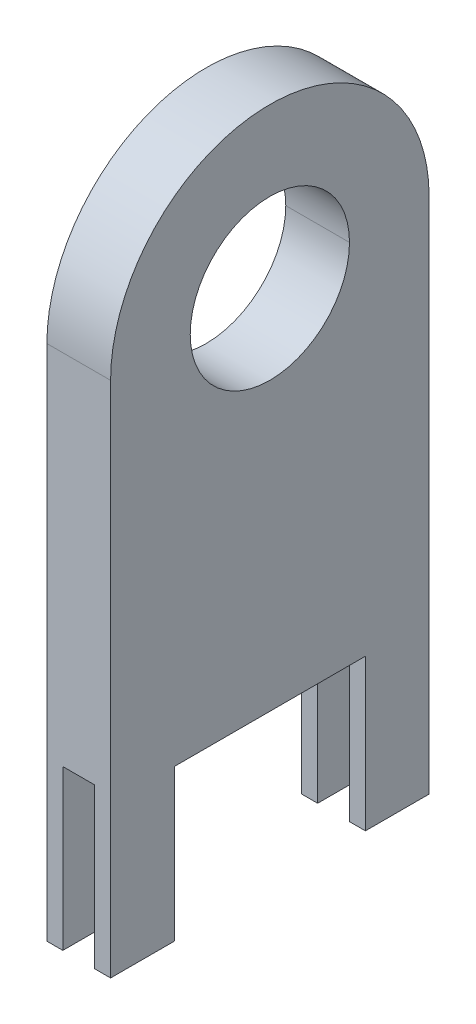
ISO-10303-21;
HEADER;
FILE_DESCRIPTION(('STEP AP214'),'2;1');
FILE_NAME('part.step','',(''),(''),'','','');
FILE_SCHEMA(('AUTOMOTIVE_DESIGN { 1 0 10303 214 1 1 1 1 }'));
ENDSEC;
DATA;
#1=APPLICATION_CONTEXT('core data for automotive mechanical design processes');
#2=APPLICATION_PROTOCOL_DEFINITION('international standard','automotive_design',2000,#1);
#3=PRODUCT_CONTEXT('',#1,'mechanical');
#4=PRODUCT('Part','Part','',(#3));
#5=PRODUCT_RELATED_PRODUCT_CATEGORY('part','',(#4));
#6=PRODUCT_DEFINITION_FORMATION('','',#4);
#7=PRODUCT_DEFINITION_CONTEXT('part definition',#1,'design');
#8=PRODUCT_DEFINITION('design','',#6,#7);
#9=PRODUCT_DEFINITION_SHAPE('','',#8);
#10=(LENGTH_UNIT() NAMED_UNIT(*) SI_UNIT(.MILLI.,.METRE.));
#11=(NAMED_UNIT(*) PLANE_ANGLE_UNIT() SI_UNIT($,.RADIAN.));
#12=(NAMED_UNIT(*) SI_UNIT($,.STERADIAN.) SOLID_ANGLE_UNIT());
#13=UNCERTAINTY_MEASURE_WITH_UNIT(LENGTH_MEASURE(1.E-05),#10,'distance_accuracy_value','');
#14=(GEOMETRIC_REPRESENTATION_CONTEXT(3) GLOBAL_UNCERTAINTY_ASSIGNED_CONTEXT((#13)) GLOBAL_UNIT_ASSIGNED_CONTEXT((#10,
#11,#12)) REPRESENTATION_CONTEXT('',''));
#15=CARTESIAN_POINT('',(0.,0.,0.));
#16=DIRECTION('',(0.,0.,1.));
#17=DIRECTION('',(1.,0.,0.));
#18=AXIS2_PLACEMENT_3D('',#15,#16,#17);
#19=CARTESIAN_POINT('',(0.2,3.25,0.));
#20=DIRECTION('',(-1.,0.,0.));
#21=DIRECTION('',(0.,0.,1.));
#22=AXIS2_PLACEMENT_3D('',#19,#20,#21);
#23=CYLINDRICAL_SURFACE('',#22,1.);
#24=CARTESIAN_POINT('',(-0.2,3.25,0.));
#25=DIRECTION('',(-1.,0.,0.));
#26=DIRECTION('',(0.,0.,1.));
#27=AXIS2_PLACEMENT_3D('',#24,#25,#26);
#28=CIRCLE('',#27,1.);
#29=CARTESIAN_POINT('',(-0.2,3.25,1.));
#30=VERTEX_POINT('',#29);
#31=CARTESIAN_POINT('',(-0.2,3.25,-1.));
#32=VERTEX_POINT('',#31);
#33=EDGE_CURVE('E225',#30,#32,#28,.T.);
#34=ORIENTED_EDGE('',*,*,#33,.F.);
#35=DIRECTION('',(-1.,0.,0.));
#36=VECTOR('',#35,1.);
#37=CARTESIAN_POINT('',(0.,3.25,1.));
#38=LINE('',#37,#36);
#39=CARTESIAN_POINT('',(0.2,3.25,1.));
#40=VERTEX_POINT('',#39);
#41=EDGE_CURVE('E11',#40,#30,#38,.T.);
#42=ORIENTED_EDGE('',*,*,#41,.F.);
#43=CARTESIAN_POINT('',(0.2,3.25,0.));
#44=DIRECTION('',(1.,0.,0.));
#45=DIRECTION('',(0.,0.,1.));
#46=AXIS2_PLACEMENT_3D('',#43,#44,#45);
#47=CIRCLE('',#46,1.);
#48=CARTESIAN_POINT('',(0.2,3.25,-1.));
#49=VERTEX_POINT('',#48);
#50=EDGE_CURVE('E269',#49,#40,#47,.T.);
#51=ORIENTED_EDGE('',*,*,#50,.F.);
#52=DIRECTION('',(-1.,0.,0.));
#53=VECTOR('',#52,1.);
#54=CARTESIAN_POINT('',(0.,3.25,-1.));
#55=LINE('',#54,#53);
#56=EDGE_CURVE('E230',#49,#32,#55,.T.);
#57=ORIENTED_EDGE('',*,*,#56,.T.);
#58=EDGE_LOOP('',(#34,#42,#51,#57));
#59=FACE_BOUND('',#58,.T.);
#60=ADVANCED_FACE('F16',(#59),#23,.T.);
#61=CARTESIAN_POINT('',(-0.21,-0.01,1.));
#62=DIRECTION('',(0.,0.,1.));
#63=DIRECTION('',(1.,0.,0.));
#64=AXIS2_PLACEMENT_3D('',#61,#62,#63);
#65=PLANE('',#64);
#66=DIRECTION('',(0.,1.,0.));
#67=VECTOR('',#66,1.);
#68=CARTESIAN_POINT('',(-0.2,2.125,1.));
#69=LINE('',#68,#67);
#70=CARTESIAN_POINT('',(-0.2,0.,1.));
#71=VERTEX_POINT('',#70);
#72=EDGE_CURVE('E287',#71,#30,#69,.T.);
#73=ORIENTED_EDGE('',*,*,#72,.F.);
#74=DIRECTION('',(-1.,0.,0.));
#75=VECTOR('',#74,1.);
#76=CARTESIAN_POINT('',(-0.15,0.,1.));
#77=LINE('',#76,#75);
#78=CARTESIAN_POINT('',(-0.1,0.,1.));
#79=VERTEX_POINT('',#78);
#80=EDGE_CURVE('E373',#79,#71,#77,.T.);
#81=ORIENTED_EDGE('',*,*,#80,.F.);
#82=DIRECTION('',(0.,-1.,0.));
#83=VECTOR('',#82,1.);
#84=CARTESIAN_POINT('',(-0.1,0.5,1.));
#85=LINE('',#84,#83);
#86=CARTESIAN_POINT('',(-0.1,1.,1.));
#87=VERTEX_POINT('',#86);
#88=EDGE_CURVE('E167',#87,#79,#85,.T.);
#89=ORIENTED_EDGE('',*,*,#88,.F.);
#90=DIRECTION('',(-1.,0.,0.));
#91=VECTOR('',#90,1.);
#92=CARTESIAN_POINT('',(0.,1.,1.));
#93=LINE('',#92,#91);
#94=CARTESIAN_POINT('',(0.1,1.,1.));
#95=VERTEX_POINT('',#94);
#96=EDGE_CURVE('E157',#95,#87,#93,.T.);
#97=ORIENTED_EDGE('',*,*,#96,.F.);
#98=DIRECTION('',(0.,1.,0.));
#99=VECTOR('',#98,1.);
#100=CARTESIAN_POINT('',(0.1,0.5,1.));
#101=LINE('',#100,#99);
#102=CARTESIAN_POINT('',(0.1,0.,1.));
#103=VERTEX_POINT('',#102);
#104=EDGE_CURVE('E304',#103,#95,#101,.T.);
#105=ORIENTED_EDGE('',*,*,#104,.F.);
#106=DIRECTION('',(-1.,0.,0.));
#107=VECTOR('',#106,1.);
#108=CARTESIAN_POINT('',(0.15,0.,1.));
#109=LINE('',#108,#107);
#110=CARTESIAN_POINT('',(0.2,0.,1.));
#111=VERTEX_POINT('',#110);
#112=EDGE_CURVE('E27',#111,#103,#109,.T.);
#113=ORIENTED_EDGE('',*,*,#112,.F.);
#114=DIRECTION('',(0.,-1.,0.));
#115=VECTOR('',#114,1.);
#116=CARTESIAN_POINT('',(0.2,2.125,1.));
#117=LINE('',#116,#115);
#118=EDGE_CURVE('E273',#40,#111,#117,.T.);
#119=ORIENTED_EDGE('',*,*,#118,.F.);
#120=ORIENTED_EDGE('',*,*,#41,.T.);
#121=EDGE_LOOP('',(#73,#81,#89,#97,#105,#113,#119,#120));
#122=FACE_BOUND('',#121,.T.);
#123=ADVANCED_FACE('F668',(#122),#65,.T.);
#124=CARTESIAN_POINT('',(0.2,3.25,0.));
#125=DIRECTION('',(-1.,0.,0.));
#126=DIRECTION('',(0.,0.,1.));
#127=AXIS2_PLACEMENT_3D('',#124,#125,#126);
#128=CYLINDRICAL_SURFACE('',#127,0.5);
#129=DIRECTION('',(-1.,0.,0.));
#130=VECTOR('',#129,1.);
#131=CARTESIAN_POINT('',(0.2,3.25,-0.5));
#132=LINE('',#131,#130);
#133=CARTESIAN_POINT('',(0.2,3.25,-0.5));
#134=VERTEX_POINT('',#133);
#135=CARTESIAN_POINT('',(-0.2,3.25,-0.5));
#136=VERTEX_POINT('',#135);
#137=EDGE_CURVE('E253',#134,#136,#132,.T.);
#138=ORIENTED_EDGE('',*,*,#137,.F.);
#139=CARTESIAN_POINT('',(0.2,3.25,0.));
#140=DIRECTION('',(-1.,0.,0.));
#141=DIRECTION('',(0.,0.,1.));
#142=AXIS2_PLACEMENT_3D('',#139,#140,#141);
#143=CIRCLE('',#142,0.5);
#144=CARTESIAN_POINT('',(0.2,3.25,0.5));
#145=VERTEX_POINT('',#144);
#146=EDGE_CURVE('E288',#145,#134,#143,.T.);
#147=ORIENTED_EDGE('',*,*,#146,.F.);
#148=DIRECTION('',(-1.,0.,0.));
#149=VECTOR('',#148,1.);
#150=CARTESIAN_POINT('',(0.2,3.25,0.5));
#151=LINE('',#150,#149);
#152=CARTESIAN_POINT('',(-0.2,3.25,0.5));
#153=VERTEX_POINT('',#152);
#154=EDGE_CURVE('E252',#145,#153,#151,.T.);
#155=ORIENTED_EDGE('',*,*,#154,.T.);
#156=CARTESIAN_POINT('',(-0.2,3.25,0.));
#157=DIRECTION('',(1.,0.,0.));
#158=DIRECTION('',(0.,0.,1.));
#159=AXIS2_PLACEMENT_3D('',#156,#157,#158);
#160=CIRCLE('',#159,0.5);
#161=EDGE_CURVE('E342',#136,#153,#160,.T.);
#162=ORIENTED_EDGE('',*,*,#161,.F.);
#163=EDGE_LOOP('',(#138,#147,#155,#162));
#164=FACE_BOUND('',#163,.T.);
#165=ADVANCED_FACE('F672',(#164),#128,.F.);
#166=CARTESIAN_POINT('',(0.09,0.,1.01));
#167=DIRECTION('',(0.,-1.,0.));
#168=DIRECTION('',(0.,0.,-1.));
#169=AXIS2_PLACEMENT_3D('',#166,#167,#168);
#170=PLANE('',#169);
#171=DIRECTION('',(0.,0.,-1.));
#172=VECTOR('',#171,1.);
#173=CARTESIAN_POINT('',(0.2,0.,0.));
#174=LINE('',#173,#172);
#175=CARTESIAN_POINT('',(0.2,0.,0.6));
#176=VERTEX_POINT('',#175);
#177=EDGE_CURVE('E292',#111,#176,#174,.T.);
#178=ORIENTED_EDGE('',*,*,#177,.F.);
#179=ORIENTED_EDGE('',*,*,#112,.T.);
#180=DIRECTION('',(0.,0.,1.));
#181=VECTOR('',#180,1.);
#182=CARTESIAN_POINT('',(0.1,0.,0.8));
#183=LINE('',#182,#181);
#184=CARTESIAN_POINT('',(0.1,0.,0.6));
#185=VERTEX_POINT('',#184);
#186=EDGE_CURVE('E280',#185,#103,#183,.T.);
#187=ORIENTED_EDGE('',*,*,#186,.F.);
#188=DIRECTION('',(-1.,0.,0.));
#189=VECTOR('',#188,1.);
#190=CARTESIAN_POINT('',(0.15,0.,0.6));
#191=LINE('',#190,#189);
#192=EDGE_CURVE('E395',#176,#185,#191,.T.);
#193=ORIENTED_EDGE('',*,*,#192,.F.);
#194=EDGE_LOOP('',(#178,#179,#187,#193));
#195=FACE_BOUND('',#194,.T.);
#196=ADVANCED_FACE('F728',(#195),#170,.T.);
#197=CARTESIAN_POINT('',(0.1,-0.01,0.59));
#198=DIRECTION('',(-1.,0.,0.));
#199=DIRECTION('',(0.,0.,1.));
#200=AXIS2_PLACEMENT_3D('',#197,#198,#199);
#201=PLANE('',#200);
#202=DIRECTION('',(0.,1.,0.));
#203=VECTOR('',#202,1.);
#204=CARTESIAN_POINT('',(0.1,0.975,0.6));
#205=LINE('',#204,#203);
#206=CARTESIAN_POINT('',(0.1,0.95,0.6));
#207=VERTEX_POINT('',#206);
#208=CARTESIAN_POINT('',(0.1,1.,0.6));
#209=VERTEX_POINT('',#208);
#210=EDGE_CURVE('E267',#207,#209,#205,.T.);
#211=ORIENTED_EDGE('',*,*,#210,.F.);
#212=DIRECTION('',(0.,1.,0.));
#213=VECTOR('',#212,1.);
#214=CARTESIAN_POINT('',(0.1,0.475,0.6));
#215=LINE('',#214,#213);
#216=EDGE_CURVE('E247',#185,#207,#215,.T.);
#217=ORIENTED_EDGE('',*,*,#216,.F.);
#218=ORIENTED_EDGE('',*,*,#186,.T.);
#219=ORIENTED_EDGE('',*,*,#104,.T.);
#220=DIRECTION('',(0.,0.,1.));
#221=VECTOR('',#220,1.);
#222=CARTESIAN_POINT('',(0.1,1.,0.8));
#223=LINE('',#222,#221);
#224=EDGE_CURVE('E281',#209,#95,#223,.T.);
#225=ORIENTED_EDGE('',*,*,#224,.F.);
#226=EDGE_LOOP('',(#211,#217,#218,#219,#225));
#227=FACE_BOUND('',#226,.T.);
#228=ADVANCED_FACE('F18',(#227),#201,.T.);
#229=CARTESIAN_POINT('',(-0.11,1.,1.01));
#230=DIRECTION('',(0.,-1.,0.));
#231=DIRECTION('',(0.,0.,-1.));
#232=AXIS2_PLACEMENT_3D('',#229,#230,#231);
#233=PLANE('',#232);
#234=ORIENTED_EDGE('',*,*,#224,.T.);
#235=ORIENTED_EDGE('',*,*,#96,.T.);
#236=DIRECTION('',(0.,0.,1.));
#237=VECTOR('',#236,1.);
#238=CARTESIAN_POINT('',(-0.1,1.,0.8));
#239=LINE('',#238,#237);
#240=CARTESIAN_POINT('',(-0.1,1.,0.6));
#241=VERTEX_POINT('',#240);
#242=EDGE_CURVE('E351',#241,#87,#239,.T.);
#243=ORIENTED_EDGE('',*,*,#242,.F.);
#244=DIRECTION('',(-1.,0.,0.));
#245=VECTOR('',#244,1.);
#246=CARTESIAN_POINT('',(0.,1.,0.6));
#247=LINE('',#246,#245);
#248=EDGE_CURVE('E268',#209,#241,#247,.T.);
#249=ORIENTED_EDGE('',*,*,#248,.F.);
#250=EDGE_LOOP('',(#234,#235,#243,#249));
#251=FACE_BOUND('',#250,.T.);
#252=ADVANCED_FACE('F788',(#251),#233,.T.);
#253=CARTESIAN_POINT('',(-0.1,-0.01,1.01));
#254=DIRECTION('',(1.,0.,0.));
#255=DIRECTION('',(0.,1.,0.));
#256=AXIS2_PLACEMENT_3D('',#253,#254,#255);
#257=PLANE('',#256);
#258=ORIENTED_EDGE('',*,*,#242,.T.);
#259=ORIENTED_EDGE('',*,*,#88,.T.);
#260=DIRECTION('',(0.,0.,1.));
#261=VECTOR('',#260,1.);
#262=CARTESIAN_POINT('',(-0.1,0.,0.8));
#263=LINE('',#262,#261);
#264=CARTESIAN_POINT('',(-0.1,0.,0.6));
#265=VERTEX_POINT('',#264);
#266=EDGE_CURVE('E376',#265,#79,#263,.T.);
#267=ORIENTED_EDGE('',*,*,#266,.F.);
#268=DIRECTION('',(0.,-1.,0.));
#269=VECTOR('',#268,1.);
#270=CARTESIAN_POINT('',(-0.1,0.475,0.6));
#271=LINE('',#270,#269);
#272=CARTESIAN_POINT('',(-0.1,0.95,0.6));
#273=VERTEX_POINT('',#272);
#274=EDGE_CURVE('E377',#273,#265,#271,.T.);
#275=ORIENTED_EDGE('',*,*,#274,.F.);
#276=DIRECTION('',(0.,-1.,0.));
#277=VECTOR('',#276,1.);
#278=CARTESIAN_POINT('',(-0.1,0.975,0.6));
#279=LINE('',#278,#277);
#280=EDGE_CURVE('E264',#241,#273,#279,.T.);
#281=ORIENTED_EDGE('',*,*,#280,.F.);
#282=EDGE_LOOP('',(#258,#259,#267,#275,#281));
#283=FACE_BOUND('',#282,.T.);
#284=ADVANCED_FACE('F792',(#283),#257,.T.);
#285=CARTESIAN_POINT('',(-0.21,0.,1.01));
#286=DIRECTION('',(0.,-1.,0.));
#287=DIRECTION('',(0.,0.,-1.));
#288=AXIS2_PLACEMENT_3D('',#285,#286,#287);
#289=PLANE('',#288);
#290=DIRECTION('',(0.,0.,1.));
#291=VECTOR('',#290,1.);
#292=CARTESIAN_POINT('',(-0.2,0.,0.));
#293=LINE('',#292,#291);
#294=CARTESIAN_POINT('',(-0.2,0.,0.6));
#295=VERTEX_POINT('',#294);
#296=EDGE_CURVE('E283',#295,#71,#293,.T.);
#297=ORIENTED_EDGE('',*,*,#296,.F.);
#298=DIRECTION('',(-1.,0.,0.));
#299=VECTOR('',#298,1.);
#300=CARTESIAN_POINT('',(-0.15,0.,0.6));
#301=LINE('',#300,#299);
#302=EDGE_CURVE('E357',#265,#295,#301,.T.);
#303=ORIENTED_EDGE('',*,*,#302,.F.);
#304=ORIENTED_EDGE('',*,*,#266,.T.);
#305=ORIENTED_EDGE('',*,*,#80,.T.);
#306=EDGE_LOOP('',(#297,#303,#304,#305));
#307=FACE_BOUND('',#306,.T.);
#308=ADVANCED_FACE('F746',(#307),#289,.T.);
#309=CARTESIAN_POINT('',(-0.2,-0.01,-1.01));
#310=DIRECTION('',(-1.,0.,0.));
#311=DIRECTION('',(0.,0.,1.));
#312=AXIS2_PLACEMENT_3D('',#309,#310,#311);
#313=PLANE('',#312);
#314=CARTESIAN_POINT('',(-0.2,3.25,0.));
#315=DIRECTION('',(1.,0.,0.));
#316=DIRECTION('',(0.,0.,1.));
#317=AXIS2_PLACEMENT_3D('',#314,#315,#316);
#318=CIRCLE('',#317,0.5);
#319=EDGE_CURVE('E249',#153,#136,#318,.T.);
#320=ORIENTED_EDGE('',*,*,#319,.T.);
#321=ORIENTED_EDGE('',*,*,#161,.T.);
#322=EDGE_LOOP('',(#320,#321));
#323=FACE_BOUND('',#322,.T.);
#324=DIRECTION('',(0.,1.,0.));
#325=VECTOR('',#324,1.);
#326=CARTESIAN_POINT('',(-0.2,1.625,-1.));
#327=LINE('',#326,#325);
#328=CARTESIAN_POINT('',(-0.2,0.,-1.));
#329=VERTEX_POINT('',#328);
#330=EDGE_CURVE('E221',#329,#32,#327,.T.);
#331=ORIENTED_EDGE('',*,*,#330,.F.);
#332=DIRECTION('',(0.,0.,-1.));
#333=VECTOR('',#332,1.);
#334=CARTESIAN_POINT('',(-0.2,0.,-0.8));
#335=LINE('',#334,#333);
#336=CARTESIAN_POINT('',(-0.2,0.,-0.6));
#337=VERTEX_POINT('',#336);
#338=EDGE_CURVE('E207',#337,#329,#335,.T.);
#339=ORIENTED_EDGE('',*,*,#338,.F.);
#340=DIRECTION('',(0.,-1.,0.));
#341=VECTOR('',#340,1.);
#342=CARTESIAN_POINT('',(-0.2,0.475,-0.6));
#343=LINE('',#342,#341);
#344=CARTESIAN_POINT('',(-0.2,0.95,-0.6));
#345=VERTEX_POINT('',#344);
#346=EDGE_CURVE('E345',#345,#337,#343,.T.);
#347=ORIENTED_EDGE('',*,*,#346,.F.);
#348=DIRECTION('',(0.,0.,1.));
#349=VECTOR('',#348,1.);
#350=CARTESIAN_POINT('',(-0.2,0.95,0.));
#351=LINE('',#350,#349);
#352=CARTESIAN_POINT('',(-0.2,0.95,0.6));
#353=VERTEX_POINT('',#352);
#354=EDGE_CURVE('E295',#345,#353,#351,.T.);
#355=ORIENTED_EDGE('',*,*,#354,.T.);
#356=DIRECTION('',(0.,1.,0.));
#357=VECTOR('',#356,1.);
#358=CARTESIAN_POINT('',(-0.2,0.475,0.6));
#359=LINE('',#358,#357);
#360=EDGE_CURVE('E218',#295,#353,#359,.T.);
#361=ORIENTED_EDGE('',*,*,#360,.F.);
#362=ORIENTED_EDGE('',*,*,#296,.T.);
#363=ORIENTED_EDGE('',*,*,#72,.T.);
#364=ORIENTED_EDGE('',*,*,#33,.T.);
#365=EDGE_LOOP('',(#331,#339,#347,#355,#361,#362,#363,#364));
#366=FACE_BOUND('',#365,.T.);
#367=ADVANCED_FACE('F222',(#323,#366),#313,.T.);
#368=CARTESIAN_POINT('',(0.2,-0.01,1.01));
#369=DIRECTION('',(1.,0.,0.));
#370=DIRECTION('',(0.,1.,0.));
#371=AXIS2_PLACEMENT_3D('',#368,#369,#370);
#372=PLANE('',#371);
#373=ORIENTED_EDGE('',*,*,#146,.T.);
#374=CARTESIAN_POINT('',(0.2,3.25,0.));
#375=DIRECTION('',(-1.,0.,0.));
#376=DIRECTION('',(0.,0.,1.));
#377=AXIS2_PLACEMENT_3D('',#374,#375,#376);
#378=CIRCLE('',#377,0.5);
#379=EDGE_CURVE('E263',#134,#145,#378,.T.);
#380=ORIENTED_EDGE('',*,*,#379,.T.);
#381=EDGE_LOOP('',(#373,#380));
#382=FACE_BOUND('',#381,.T.);
#383=DIRECTION('',(0.,-1.,0.));
#384=VECTOR('',#383,1.);
#385=CARTESIAN_POINT('',(0.2,0.475,0.6));
#386=LINE('',#385,#384);
#387=CARTESIAN_POINT('',(0.2,0.95,0.6));
#388=VERTEX_POINT('',#387);
#389=EDGE_CURVE('E320',#388,#176,#386,.T.);
#390=ORIENTED_EDGE('',*,*,#389,.F.);
#391=DIRECTION('',(0.,0.,-1.));
#392=VECTOR('',#391,1.);
#393=CARTESIAN_POINT('',(0.2,0.95,0.));
#394=LINE('',#393,#392);
#395=CARTESIAN_POINT('',(0.2,0.95,-0.6));
#396=VERTEX_POINT('',#395);
#397=EDGE_CURVE('E361',#388,#396,#394,.T.);
#398=ORIENTED_EDGE('',*,*,#397,.T.);
#399=DIRECTION('',(0.,1.,0.));
#400=VECTOR('',#399,1.);
#401=CARTESIAN_POINT('',(0.2,0.475,-0.6));
#402=LINE('',#401,#400);
#403=CARTESIAN_POINT('',(0.2,0.,-0.6));
#404=VERTEX_POINT('',#403);
#405=EDGE_CURVE('E312',#404,#396,#402,.T.);
#406=ORIENTED_EDGE('',*,*,#405,.F.);
#407=DIRECTION('',(0.,0.,1.));
#408=VECTOR('',#407,1.);
#409=CARTESIAN_POINT('',(0.2,0.,-0.8));
#410=LINE('',#409,#408);
#411=CARTESIAN_POINT('',(0.2,0.,-1.));
#412=VERTEX_POINT('',#411);
#413=EDGE_CURVE('E311',#412,#404,#410,.T.);
#414=ORIENTED_EDGE('',*,*,#413,.F.);
#415=DIRECTION('',(0.,-1.,0.));
#416=VECTOR('',#415,1.);
#417=CARTESIAN_POINT('',(0.2,1.625,-1.));
#418=LINE('',#417,#416);
#419=EDGE_CURVE('E244',#49,#412,#418,.T.);
#420=ORIENTED_EDGE('',*,*,#419,.F.);
#421=ORIENTED_EDGE('',*,*,#50,.T.);
#422=ORIENTED_EDGE('',*,*,#118,.T.);
#423=ORIENTED_EDGE('',*,*,#177,.T.);
#424=EDGE_LOOP('',(#390,#398,#406,#414,#420,#421,#422,#423));
#425=FACE_BOUND('',#424,.T.);
#426=ADVANCED_FACE('F709',(#382,#425),#372,.T.);
#427=CARTESIAN_POINT('',(0.21,-0.01,0.6));
#428=DIRECTION('',(0.,0.,-1.));
#429=DIRECTION('',(0.,-1.,0.));
#430=AXIS2_PLACEMENT_3D('',#427,#428,#429);
#431=PLANE('',#430);
#432=ORIENTED_EDGE('',*,*,#389,.T.);
#433=ORIENTED_EDGE('',*,*,#192,.T.);
#434=ORIENTED_EDGE('',*,*,#216,.T.);
#435=DIRECTION('',(-1.,0.,0.));
#436=VECTOR('',#435,1.);
#437=CARTESIAN_POINT('',(0.,0.95,0.6));
#438=LINE('',#437,#436);
#439=EDGE_CURVE('E372',#388,#207,#438,.T.);
#440=ORIENTED_EDGE('',*,*,#439,.F.);
#441=EDGE_LOOP('',(#432,#433,#434,#440));
#442=FACE_BOUND('',#441,.T.);
#443=ADVANCED_FACE('F475',(#442),#431,.T.);
#444=CARTESIAN_POINT('',(-0.11,0.945,0.6));
#445=DIRECTION('',(0.,0.,1.));
#446=DIRECTION('',(1.,0.,0.));
#447=AXIS2_PLACEMENT_3D('',#444,#445,#446);
#448=PLANE('',#447);
#449=ORIENTED_EDGE('',*,*,#248,.T.);
#450=ORIENTED_EDGE('',*,*,#280,.T.);
#451=DIRECTION('',(-1.,0.,0.));
#452=VECTOR('',#451,1.);
#453=CARTESIAN_POINT('',(0.,0.95,0.6));
#454=LINE('',#453,#452);
#455=EDGE_CURVE('E328',#207,#273,#454,.T.);
#456=ORIENTED_EDGE('',*,*,#455,.F.);
#457=ORIENTED_EDGE('',*,*,#210,.T.);
#458=EDGE_LOOP('',(#449,#450,#456,#457));
#459=FACE_BOUND('',#458,.T.);
#460=ADVANCED_FACE('F481',(#459),#448,.T.);
#461=CARTESIAN_POINT('',(-0.09,-0.01,0.6));
#462=DIRECTION('',(0.,0.,-1.));
#463=DIRECTION('',(0.,-1.,0.));
#464=AXIS2_PLACEMENT_3D('',#461,#462,#463);
#465=PLANE('',#464);
#466=ORIENTED_EDGE('',*,*,#360,.T.);
#467=DIRECTION('',(-1.,0.,0.));
#468=VECTOR('',#467,1.);
#469=CARTESIAN_POINT('',(0.,0.95,0.6));
#470=LINE('',#469,#468);
#471=EDGE_CURVE('E324',#273,#353,#470,.T.);
#472=ORIENTED_EDGE('',*,*,#471,.F.);
#473=ORIENTED_EDGE('',*,*,#274,.T.);
#474=ORIENTED_EDGE('',*,*,#302,.T.);
#475=EDGE_LOOP('',(#466,#472,#473,#474));
#476=FACE_BOUND('',#475,.T.);
#477=ADVANCED_FACE('F734',(#476),#465,.T.);
#478=CARTESIAN_POINT('',(-0.21,0.,-0.59));
#479=DIRECTION('',(0.,-1.,0.));
#480=DIRECTION('',(0.,0.,-1.));
#481=AXIS2_PLACEMENT_3D('',#478,#479,#480);
#482=PLANE('',#481);
#483=ORIENTED_EDGE('',*,*,#338,.T.);
#484=DIRECTION('',(-1.,0.,0.));
#485=VECTOR('',#484,1.);
#486=CARTESIAN_POINT('',(0.,0.,-1.));
#487=LINE('',#486,#485);
#488=CARTESIAN_POINT('',(-0.1,0.,-1.));
#489=VERTEX_POINT('',#488);
#490=EDGE_CURVE('E212',#489,#329,#487,.T.);
#491=ORIENTED_EDGE('',*,*,#490,.F.);
#492=DIRECTION('',(0.,0.,-1.));
#493=VECTOR('',#492,1.);
#494=CARTESIAN_POINT('',(-0.1,0.,-0.8));
#495=LINE('',#494,#493);
#496=CARTESIAN_POINT('',(-0.1,0.,-0.6));
#497=VERTEX_POINT('',#496);
#498=EDGE_CURVE('E298',#497,#489,#495,.T.);
#499=ORIENTED_EDGE('',*,*,#498,.F.);
#500=DIRECTION('',(1.,0.,0.));
#501=VECTOR('',#500,1.);
#502=CARTESIAN_POINT('',(-0.15,0.,-0.6));
#503=LINE('',#502,#501);
#504=EDGE_CURVE('E214',#337,#497,#503,.T.);
#505=ORIENTED_EDGE('',*,*,#504,.F.);
#506=EDGE_LOOP('',(#483,#491,#499,#505));
#507=FACE_BOUND('',#506,.T.);
#508=ADVANCED_FACE('F209',(#507),#482,.T.);
#509=CARTESIAN_POINT('',(-0.21,-0.01,-0.6));
#510=DIRECTION('',(0.,0.,1.));
#511=DIRECTION('',(1.,0.,0.));
#512=AXIS2_PLACEMENT_3D('',#509,#510,#511);
#513=PLANE('',#512);
#514=ORIENTED_EDGE('',*,*,#346,.T.);
#515=ORIENTED_EDGE('',*,*,#504,.T.);
#516=DIRECTION('',(0.,-1.,0.));
#517=VECTOR('',#516,1.);
#518=CARTESIAN_POINT('',(-0.1,0.5,-0.6));
#519=LINE('',#518,#517);
#520=CARTESIAN_POINT('',(-0.1,0.95,-0.6));
#521=VERTEX_POINT('',#520);
#522=EDGE_CURVE('E301',#521,#497,#519,.T.);
#523=ORIENTED_EDGE('',*,*,#522,.F.);
#524=DIRECTION('',(1.,0.,0.));
#525=VECTOR('',#524,1.);
#526=CARTESIAN_POINT('',(0.,0.95,-0.6));
#527=LINE('',#526,#525);
#528=EDGE_CURVE('E322',#345,#521,#527,.T.);
#529=ORIENTED_EDGE('',*,*,#528,.F.);
#530=EDGE_LOOP('',(#514,#515,#523,#529));
#531=FACE_BOUND('',#530,.T.);
#532=ADVANCED_FACE('F450',(#531),#513,.T.);
#533=CARTESIAN_POINT('',(0.09,0.,-0.59));
#534=DIRECTION('',(0.,-1.,0.));
#535=DIRECTION('',(0.,0.,-1.));
#536=AXIS2_PLACEMENT_3D('',#533,#534,#535);
#537=PLANE('',#536);
#538=ORIENTED_EDGE('',*,*,#413,.T.);
#539=DIRECTION('',(1.,0.,0.));
#540=VECTOR('',#539,1.);
#541=CARTESIAN_POINT('',(0.15,0.,-0.6));
#542=LINE('',#541,#540);
#543=CARTESIAN_POINT('',(0.1,0.,-0.6));
#544=VERTEX_POINT('',#543);
#545=EDGE_CURVE('E307',#544,#404,#542,.T.);
#546=ORIENTED_EDGE('',*,*,#545,.F.);
#547=DIRECTION('',(0.,0.,1.));
#548=VECTOR('',#547,1.);
#549=CARTESIAN_POINT('',(0.1,0.,-0.8));
#550=LINE('',#549,#548);
#551=CARTESIAN_POINT('',(0.1,0.,-1.));
#552=VERTEX_POINT('',#551);
#553=EDGE_CURVE('E387',#552,#544,#550,.T.);
#554=ORIENTED_EDGE('',*,*,#553,.F.);
#555=DIRECTION('',(-1.,0.,0.));
#556=VECTOR('',#555,1.);
#557=CARTESIAN_POINT('',(0.,0.,-1.));
#558=LINE('',#557,#556);
#559=EDGE_CURVE('E20',#412,#552,#558,.T.);
#560=ORIENTED_EDGE('',*,*,#559,.F.);
#561=EDGE_LOOP('',(#538,#546,#554,#560));
#562=FACE_BOUND('',#561,.T.);
#563=ADVANCED_FACE('F434',(#562),#537,.T.);
#564=CARTESIAN_POINT('',(0.09,-0.01,-0.6));
#565=DIRECTION('',(0.,0.,1.));
#566=DIRECTION('',(1.,0.,0.));
#567=AXIS2_PLACEMENT_3D('',#564,#565,#566);
#568=PLANE('',#567);
#569=ORIENTED_EDGE('',*,*,#405,.T.);
#570=DIRECTION('',(1.,0.,0.));
#571=VECTOR('',#570,1.);
#572=CARTESIAN_POINT('',(0.,0.95,-0.6));
#573=LINE('',#572,#571);
#574=CARTESIAN_POINT('',(0.1,0.95,-0.6));
#575=VERTEX_POINT('',#574);
#576=EDGE_CURVE('E348',#575,#396,#573,.T.);
#577=ORIENTED_EDGE('',*,*,#576,.F.);
#578=DIRECTION('',(0.,1.,0.));
#579=VECTOR('',#578,1.);
#580=CARTESIAN_POINT('',(0.1,0.5,-0.6));
#581=LINE('',#580,#579);
#582=EDGE_CURVE('E366',#544,#575,#581,.T.);
#583=ORIENTED_EDGE('',*,*,#582,.F.);
#584=ORIENTED_EDGE('',*,*,#545,.T.);
#585=EDGE_LOOP('',(#569,#577,#583,#584));
#586=FACE_BOUND('',#585,.T.);
#587=ADVANCED_FACE('F704',(#586),#568,.T.);
#588=CARTESIAN_POINT('',(0.21,-0.01,-1.));
#589=DIRECTION('',(0.,0.,-1.));
#590=DIRECTION('',(0.,-1.,0.));
#591=AXIS2_PLACEMENT_3D('',#588,#589,#590);
#592=PLANE('',#591);
#593=ORIENTED_EDGE('',*,*,#419,.T.);
#594=ORIENTED_EDGE('',*,*,#559,.T.);
#595=DIRECTION('',(0.,-1.,0.));
#596=VECTOR('',#595,1.);
#597=CARTESIAN_POINT('',(0.1,0.5,-1.));
#598=LINE('',#597,#596);
#599=CARTESIAN_POINT('',(0.1,1.,-1.));
#600=VERTEX_POINT('',#599);
#601=EDGE_CURVE('E411',#600,#552,#598,.T.);
#602=ORIENTED_EDGE('',*,*,#601,.F.);
#603=DIRECTION('',(1.,0.,0.));
#604=VECTOR('',#603,1.);
#605=CARTESIAN_POINT('',(0.,1.,-1.));
#606=LINE('',#605,#604);
#607=CARTESIAN_POINT('',(-0.1,1.,-1.));
#608=VERTEX_POINT('',#607);
#609=EDGE_CURVE('E316',#608,#600,#606,.T.);
#610=ORIENTED_EDGE('',*,*,#609,.F.);
#611=DIRECTION('',(0.,1.,0.));
#612=VECTOR('',#611,1.);
#613=CARTESIAN_POINT('',(-0.1,0.5,-1.));
#614=LINE('',#613,#612);
#615=EDGE_CURVE('E235',#489,#608,#614,.T.);
#616=ORIENTED_EDGE('',*,*,#615,.F.);
#617=ORIENTED_EDGE('',*,*,#490,.T.);
#618=ORIENTED_EDGE('',*,*,#330,.T.);
#619=ORIENTED_EDGE('',*,*,#56,.F.);
#620=EDGE_LOOP('',(#593,#594,#602,#610,#616,#617,#618,#619));
#621=FACE_BOUND('',#620,.T.);
#622=ADVANCED_FACE('F233',(#621),#592,.T.);
#623=CARTESIAN_POINT('',(-0.21,0.95,0.61));
#624=DIRECTION('',(0.,-1.,0.));
#625=DIRECTION('',(0.,0.,-1.));
#626=AXIS2_PLACEMENT_3D('',#623,#624,#625);
#627=PLANE('',#626);
#628=ORIENTED_EDGE('',*,*,#528,.T.);
#629=DIRECTION('',(-1.,0.,0.));
#630=VECTOR('',#629,1.);
#631=CARTESIAN_POINT('',(0.,0.95,-0.6));
#632=LINE('',#631,#630);
#633=EDGE_CURVE('E259',#575,#521,#632,.T.);
#634=ORIENTED_EDGE('',*,*,#633,.F.);
#635=ORIENTED_EDGE('',*,*,#576,.T.);
#636=ORIENTED_EDGE('',*,*,#397,.F.);
#637=ORIENTED_EDGE('',*,*,#439,.T.);
#638=ORIENTED_EDGE('',*,*,#455,.T.);
#639=ORIENTED_EDGE('',*,*,#471,.T.);
#640=ORIENTED_EDGE('',*,*,#354,.F.);
#641=EDGE_LOOP('',(#628,#634,#635,#636,#637,#638,#639,#640));
#642=FACE_BOUND('',#641,.T.);
#643=ADVANCED_FACE('F439',(#642),#627,.T.);
#644=CARTESIAN_POINT('',(-0.1,-0.01,-0.59));
#645=DIRECTION('',(1.,0.,0.));
#646=DIRECTION('',(0.,1.,0.));
#647=AXIS2_PLACEMENT_3D('',#644,#645,#646);
#648=PLANE('',#647);
#649=DIRECTION('',(0.,1.,0.));
#650=VECTOR('',#649,1.);
#651=CARTESIAN_POINT('',(-0.1,0.975,-0.6));
#652=LINE('',#651,#650);
#653=CARTESIAN_POINT('',(-0.1,1.,-0.6));
#654=VERTEX_POINT('',#653);
#655=EDGE_CURVE('E254',#521,#654,#652,.T.);
#656=ORIENTED_EDGE('',*,*,#655,.F.);
#657=ORIENTED_EDGE('',*,*,#522,.T.);
#658=ORIENTED_EDGE('',*,*,#498,.T.);
#659=ORIENTED_EDGE('',*,*,#615,.T.);
#660=DIRECTION('',(0.,0.,-1.));
#661=VECTOR('',#660,1.);
#662=CARTESIAN_POINT('',(-0.1,1.,-0.8));
#663=LINE('',#662,#661);
#664=EDGE_CURVE('E362',#654,#608,#663,.T.);
#665=ORIENTED_EDGE('',*,*,#664,.F.);
#666=EDGE_LOOP('',(#656,#657,#658,#659,#665));
#667=FACE_BOUND('',#666,.T.);
#668=ADVANCED_FACE('F448',(#667),#648,.T.);
#669=CARTESIAN_POINT('',(-0.11,1.,-0.59));
#670=DIRECTION('',(0.,-1.,0.));
#671=DIRECTION('',(0.,0.,-1.));
#672=AXIS2_PLACEMENT_3D('',#669,#670,#671);
#673=PLANE('',#672);
#674=ORIENTED_EDGE('',*,*,#664,.T.);
#675=ORIENTED_EDGE('',*,*,#609,.T.);
#676=DIRECTION('',(0.,0.,-1.));
#677=VECTOR('',#676,1.);
#678=CARTESIAN_POINT('',(0.1,1.,-0.8));
#679=LINE('',#678,#677);
#680=CARTESIAN_POINT('',(0.1,1.,-0.6));
#681=VERTEX_POINT('',#680);
#682=EDGE_CURVE('E258',#681,#600,#679,.T.);
#683=ORIENTED_EDGE('',*,*,#682,.F.);
#684=DIRECTION('',(1.,0.,0.));
#685=VECTOR('',#684,1.);
#686=CARTESIAN_POINT('',(0.,1.,-0.6));
#687=LINE('',#686,#685);
#688=EDGE_CURVE('E274',#654,#681,#687,.T.);
#689=ORIENTED_EDGE('',*,*,#688,.F.);
#690=EDGE_LOOP('',(#674,#675,#683,#689));
#691=FACE_BOUND('',#690,.T.);
#692=ADVANCED_FACE('F427',(#691),#673,.T.);
#693=CARTESIAN_POINT('',(0.1,-0.01,-1.01));
#694=DIRECTION('',(-1.,0.,0.));
#695=DIRECTION('',(0.,0.,1.));
#696=AXIS2_PLACEMENT_3D('',#693,#694,#695);
#697=PLANE('',#696);
#698=ORIENTED_EDGE('',*,*,#682,.T.);
#699=ORIENTED_EDGE('',*,*,#601,.T.);
#700=ORIENTED_EDGE('',*,*,#553,.T.);
#701=ORIENTED_EDGE('',*,*,#582,.T.);
#702=DIRECTION('',(0.,-1.,0.));
#703=VECTOR('',#702,1.);
#704=CARTESIAN_POINT('',(0.1,0.975,-0.6));
#705=LINE('',#704,#703);
#706=EDGE_CURVE('E278',#681,#575,#705,.T.);
#707=ORIENTED_EDGE('',*,*,#706,.F.);
#708=EDGE_LOOP('',(#698,#699,#700,#701,#707));
#709=FACE_BOUND('',#708,.T.);
#710=ADVANCED_FACE('F423',(#709),#697,.T.);
#711=CARTESIAN_POINT('',(0.11,0.945,-0.6));
#712=DIRECTION('',(0.,0.,-1.));
#713=DIRECTION('',(0.,-1.,0.));
#714=AXIS2_PLACEMENT_3D('',#711,#712,#713);
#715=PLANE('',#714);
#716=ORIENTED_EDGE('',*,*,#688,.T.);
#717=ORIENTED_EDGE('',*,*,#706,.T.);
#718=ORIENTED_EDGE('',*,*,#633,.T.);
#719=ORIENTED_EDGE('',*,*,#655,.T.);
#720=EDGE_LOOP('',(#716,#717,#718,#719));
#721=FACE_BOUND('',#720,.T.);
#722=ADVANCED_FACE('F445',(#721),#715,.T.);
#723=CARTESIAN_POINT('',(0.2,3.25,0.));
#724=DIRECTION('',(-1.,0.,0.));
#725=DIRECTION('',(0.,0.,1.));
#726=AXIS2_PLACEMENT_3D('',#723,#724,#725);
#727=CYLINDRICAL_SURFACE('',#726,0.5);
#728=ORIENTED_EDGE('',*,*,#379,.F.);
#729=ORIENTED_EDGE('',*,*,#137,.T.);
#730=ORIENTED_EDGE('',*,*,#319,.F.);
#731=ORIENTED_EDGE('',*,*,#154,.F.);
#732=EDGE_LOOP('',(#728,#729,#730,#731));
#733=FACE_BOUND('',#732,.T.);
#734=ADVANCED_FACE('F692',(#733),#727,.F.);
#735=CLOSED_SHELL('',(#60,#123,#165,#196,#228,#252,#284,#308,#367,#426,#443,#460,#477,#508,#532,
#563,#587,#622,#643,#668,#692,#710,#722,#734));
#736=MANIFOLD_SOLID_BREP('B1',#735);
#737=ADVANCED_BREP_SHAPE_REPRESENTATION('',(#18,#736),#14);
#738=SHAPE_DEFINITION_REPRESENTATION(#9,#737);
ENDSEC;
END-ISO-10303-21;
